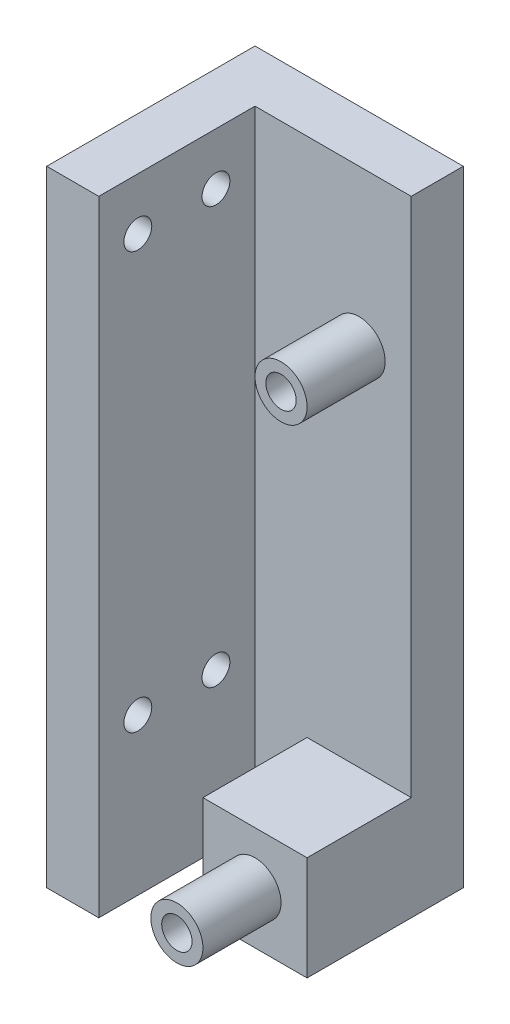
ISO-10303-21;
HEADER;
FILE_DESCRIPTION(('STEP AP214'),'2;1');
FILE_NAME('part.step','',(''),(''),'','','');
FILE_SCHEMA(('AUTOMOTIVE_DESIGN { 1 0 10303 214 1 1 1 1 }'));
ENDSEC;
DATA;
#1=APPLICATION_CONTEXT('core data for automotive mechanical design processes');
#2=APPLICATION_PROTOCOL_DEFINITION('international standard','automotive_design',2000,#1);
#3=PRODUCT_CONTEXT('',#1,'mechanical');
#4=PRODUCT('Part','Part','',(#3));
#5=PRODUCT_RELATED_PRODUCT_CATEGORY('part','',(#4));
#6=PRODUCT_DEFINITION_FORMATION('','',#4);
#7=PRODUCT_DEFINITION_CONTEXT('part definition',#1,'design');
#8=PRODUCT_DEFINITION('design','',#6,#7);
#9=PRODUCT_DEFINITION_SHAPE('','',#8);
#10=(LENGTH_UNIT() NAMED_UNIT(*) SI_UNIT(.MILLI.,.METRE.));
#11=(NAMED_UNIT(*) PLANE_ANGLE_UNIT() SI_UNIT($,.RADIAN.));
#12=(NAMED_UNIT(*) SI_UNIT($,.STERADIAN.) SOLID_ANGLE_UNIT());
#13=UNCERTAINTY_MEASURE_WITH_UNIT(LENGTH_MEASURE(1.E-05),#10,'distance_accuracy_value','');
#14=(GEOMETRIC_REPRESENTATION_CONTEXT(3) GLOBAL_UNCERTAINTY_ASSIGNED_CONTEXT((#13)) GLOBAL_UNIT_ASSIGNED_CONTEXT((#10,
#11,#12)) REPRESENTATION_CONTEXT('',''));
#15=CARTESIAN_POINT('',(0.,0.,0.));
#16=DIRECTION('',(0.,0.,1.));
#17=DIRECTION('',(1.,0.,0.));
#18=AXIS2_PLACEMENT_3D('',#15,#16,#17);
#19=CARTESIAN_POINT('',(0.,0.,-25.4));
#20=DIRECTION('',(-1.,0.,0.));
#21=DIRECTION('',(0.,-1.,0.));
#22=AXIS2_PLACEMENT_3D('',#19,#20,#21);
#23=PLANE('',#22);
#24=CARTESIAN_POINT('',(0.,69.85,-14.2875));
#25=DIRECTION('',(1.,0.,0.));
#26=DIRECTION('',(0.,1.,0.));
#27=AXIS2_PLACEMENT_3D('',#24,#25,#26);
#28=CIRCLE('',#27,1.700000029);
#29=CARTESIAN_POINT('',(0.,71.550000029,-14.2875));
#30=VERTEX_POINT('',#29);
#31=EDGE_CURVE('E231',#30,#30,#28,.T.);
#32=ORIENTED_EDGE('',*,*,#31,.T.);
#33=EDGE_LOOP('',(#32));
#34=FACE_BOUND('',#33,.T.);
#35=CARTESIAN_POINT('',(0.,19.0499999999999,-4.7625));
#36=DIRECTION('',(1.,0.,0.));
#37=DIRECTION('',(0.,1.,0.));
#38=AXIS2_PLACEMENT_3D('',#35,#36,#37);
#39=CIRCLE('',#38,1.700000029);
#40=CARTESIAN_POINT('',(0.,20.7500000289999,-4.7625));
#41=VERTEX_POINT('',#40);
#42=EDGE_CURVE('E235',#41,#41,#39,.T.);
#43=ORIENTED_EDGE('',*,*,#42,.T.);
#44=EDGE_LOOP('',(#43));
#45=FACE_BOUND('',#44,.T.);
#46=CARTESIAN_POINT('',(0.,19.05,-14.2875));
#47=DIRECTION('',(1.,0.,0.));
#48=DIRECTION('',(0.,1.,0.));
#49=AXIS2_PLACEMENT_3D('',#46,#47,#48);
#50=CIRCLE('',#49,1.700000029);
#51=CARTESIAN_POINT('',(0.,20.750000029,-14.2875));
#52=VERTEX_POINT('',#51);
#53=EDGE_CURVE('E239',#52,#52,#50,.T.);
#54=ORIENTED_EDGE('',*,*,#53,.T.);
#55=EDGE_LOOP('',(#54));
#56=FACE_BOUND('',#55,.T.);
#57=CARTESIAN_POINT('',(0.,69.85,-4.7625));
#58=DIRECTION('',(1.,0.,0.));
#59=DIRECTION('',(0.,1.,0.));
#60=AXIS2_PLACEMENT_3D('',#57,#58,#59);
#61=CIRCLE('',#60,1.700000029);
#62=CARTESIAN_POINT('',(0.,71.550000029,-4.7625));
#63=VERTEX_POINT('',#62);
#64=EDGE_CURVE('E243',#63,#63,#61,.T.);
#65=ORIENTED_EDGE('',*,*,#64,.T.);
#66=EDGE_LOOP('',(#65));
#67=FACE_BOUND('',#66,.T.);
#68=DIRECTION('',(0.,-1.,0.));
#69=VECTOR('',#68,1.);
#70=CARTESIAN_POINT('',(0.,0.,0.));
#71=LINE('',#70,#69);
#72=CARTESIAN_POINT('',(0.,76.2,0.));
#73=VERTEX_POINT('',#72);
#74=CARTESIAN_POINT('',(0.,0.,0.));
#75=VERTEX_POINT('',#74);
#76=EDGE_CURVE('E167',#73,#75,#71,.T.);
#77=ORIENTED_EDGE('',*,*,#76,.F.);
#78=DIRECTION('',(0.,0.,1.));
#79=VECTOR('',#78,1.);
#80=CARTESIAN_POINT('',(0.,76.2,-25.4));
#81=LINE('',#80,#79);
#82=CARTESIAN_POINT('',(0.,76.2,-25.4));
#83=VERTEX_POINT('',#82);
#84=EDGE_CURVE('E188',#83,#73,#81,.T.);
#85=ORIENTED_EDGE('',*,*,#84,.F.);
#86=DIRECTION('',(0.,-1.,0.));
#87=VECTOR('',#86,1.);
#88=CARTESIAN_POINT('',(0.,0.,-25.4));
#89=LINE('',#88,#87);
#90=CARTESIAN_POINT('',(0.,0.,-25.4));
#91=VERTEX_POINT('',#90);
#92=EDGE_CURVE('E168',#83,#91,#89,.T.);
#93=ORIENTED_EDGE('',*,*,#92,.T.);
#94=DIRECTION('',(0.,0.,1.));
#95=VECTOR('',#94,1.);
#96=CARTESIAN_POINT('',(0.,0.,-25.4));
#97=LINE('',#96,#95);
#98=EDGE_CURVE('E181',#91,#75,#97,.T.);
#99=ORIENTED_EDGE('',*,*,#98,.T.);
#100=EDGE_LOOP('',(#77,#85,#93,#99));
#101=FACE_BOUND('',#100,.T.);
#102=ADVANCED_FACE('F39',(#34,#45,#56,#67,#101),#23,.T.);
#103=CARTESIAN_POINT('',(0.,76.2,-25.4));
#104=DIRECTION('',(0.,1.,0.));
#105=DIRECTION('',(0.,0.,1.));
#106=AXIS2_PLACEMENT_3D('',#103,#104,#105);
#107=PLANE('',#106);
#108=DIRECTION('',(0.,0.,1.));
#109=VECTOR('',#108,1.);
#110=CARTESIAN_POINT('',(6.34999999999998,76.2,-19.05));
#111=LINE('',#110,#109);
#112=CARTESIAN_POINT('',(6.34999999999998,76.2,-19.05));
#113=VERTEX_POINT('',#112);
#114=CARTESIAN_POINT('',(6.34999999999998,76.2,0.));
#115=VERTEX_POINT('',#114);
#116=EDGE_CURVE('E61',#113,#115,#111,.T.);
#117=ORIENTED_EDGE('',*,*,#116,.F.);
#118=DIRECTION('',(1.,0.,0.));
#119=VECTOR('',#118,1.);
#120=CARTESIAN_POINT('',(-78.5451621680164,76.1999999999999,-19.05));
#121=LINE('',#120,#119);
#122=CARTESIAN_POINT('',(25.4,76.2,-19.05));
#123=VERTEX_POINT('',#122);
#124=EDGE_CURVE('E157',#113,#123,#121,.T.);
#125=ORIENTED_EDGE('',*,*,#124,.T.);
#126=DIRECTION('',(0.,0.,1.));
#127=VECTOR('',#126,1.);
#128=CARTESIAN_POINT('',(25.4,76.2,-25.4));
#129=LINE('',#128,#127);
#130=CARTESIAN_POINT('',(25.4,76.2,-25.4));
#131=VERTEX_POINT('',#130);
#132=EDGE_CURVE('E191',#131,#123,#129,.T.);
#133=ORIENTED_EDGE('',*,*,#132,.F.);
#134=DIRECTION('',(-1.,0.,0.));
#135=VECTOR('',#134,1.);
#136=CARTESIAN_POINT('',(0.,76.2,-25.4));
#137=LINE('',#136,#135);
#138=EDGE_CURVE('E178',#131,#83,#137,.T.);
#139=ORIENTED_EDGE('',*,*,#138,.T.);
#140=ORIENTED_EDGE('',*,*,#84,.T.);
#141=DIRECTION('',(-1.,0.,0.));
#142=VECTOR('',#141,1.);
#143=CARTESIAN_POINT('',(0.,76.2,0.));
#144=LINE('',#143,#142);
#145=EDGE_CURVE('E172',#115,#73,#144,.T.);
#146=ORIENTED_EDGE('',*,*,#145,.F.);
#147=EDGE_LOOP('',(#117,#125,#133,#139,#140,#146));
#148=FACE_BOUND('',#147,.T.);
#149=ADVANCED_FACE('F220',(#148),#107,.T.);
#150=CARTESIAN_POINT('',(25.4,0.,-25.4));
#151=DIRECTION('',(1.,0.,0.));
#152=DIRECTION('',(0.,1.,0.));
#153=AXIS2_PLACEMENT_3D('',#150,#151,#152);
#154=PLANE('',#153);
#155=DIRECTION('',(0.,1.,0.));
#156=VECTOR('',#155,1.);
#157=CARTESIAN_POINT('',(25.4,76.2,-19.05));
#158=LINE('',#157,#156);
#159=CARTESIAN_POINT('',(25.4,12.7,-19.05));
#160=VERTEX_POINT('',#159);
#161=EDGE_CURVE('E149',#160,#123,#158,.T.);
#162=ORIENTED_EDGE('',*,*,#161,.F.);
#163=DIRECTION('',(0.,0.,-1.));
#164=VECTOR('',#163,1.);
#165=CARTESIAN_POINT('',(25.4,12.7,-6.35));
#166=LINE('',#165,#164);
#167=CARTESIAN_POINT('',(25.4,12.7,-6.35));
#168=VERTEX_POINT('',#167);
#169=EDGE_CURVE('E53',#168,#160,#166,.T.);
#170=ORIENTED_EDGE('',*,*,#169,.F.);
#171=DIRECTION('',(0.,-1.,0.));
#172=VECTOR('',#171,1.);
#173=CARTESIAN_POINT('',(25.4,76.1999999999999,-6.35));
#174=LINE('',#173,#172);
#175=CARTESIAN_POINT('',(25.4,0.,-6.35000000000001));
#176=VERTEX_POINT('',#175);
#177=EDGE_CURVE('E126',#168,#176,#174,.T.);
#178=ORIENTED_EDGE('',*,*,#177,.T.);
#179=DIRECTION('',(0.,0.,1.));
#180=VECTOR('',#179,1.);
#181=CARTESIAN_POINT('',(25.4,0.,-25.4));
#182=LINE('',#181,#180);
#183=CARTESIAN_POINT('',(25.4,0.,-25.4));
#184=VERTEX_POINT('',#183);
#185=EDGE_CURVE('E194',#184,#176,#182,.T.);
#186=ORIENTED_EDGE('',*,*,#185,.F.);
#187=DIRECTION('',(0.,1.,0.));
#188=VECTOR('',#187,1.);
#189=CARTESIAN_POINT('',(25.4,0.,-25.4));
#190=LINE('',#189,#188);
#191=EDGE_CURVE('E175',#184,#131,#190,.T.);
#192=ORIENTED_EDGE('',*,*,#191,.T.);
#193=ORIENTED_EDGE('',*,*,#132,.T.);
#194=EDGE_LOOP('',(#162,#170,#178,#186,#192,#193));
#195=FACE_BOUND('',#194,.T.);
#196=ADVANCED_FACE('F225',(#195),#154,.T.);
#197=CARTESIAN_POINT('',(0.,0.,-25.4));
#198=DIRECTION('',(0.,-1.,0.));
#199=DIRECTION('',(0.,0.,-1.));
#200=AXIS2_PLACEMENT_3D('',#197,#198,#199);
#201=PLANE('',#200);
#202=DIRECTION('',(0.,0.,-1.));
#203=VECTOR('',#202,1.);
#204=CARTESIAN_POINT('',(6.34999999999999,0.,-19.05));
#205=LINE('',#204,#203);
#206=CARTESIAN_POINT('',(6.34999999999999,0.,0.));
#207=VERTEX_POINT('',#206);
#208=CARTESIAN_POINT('',(6.34999999999999,0.,-19.05));
#209=VERTEX_POINT('',#208);
#210=EDGE_CURVE('E159',#207,#209,#205,.T.);
#211=ORIENTED_EDGE('',*,*,#210,.F.);
#212=DIRECTION('',(1.,0.,0.));
#213=VECTOR('',#212,1.);
#214=CARTESIAN_POINT('',(0.,0.,0.));
#215=LINE('',#214,#213);
#216=EDGE_CURVE('E184',#75,#207,#215,.T.);
#217=ORIENTED_EDGE('',*,*,#216,.F.);
#218=ORIENTED_EDGE('',*,*,#98,.F.);
#219=DIRECTION('',(1.,0.,0.));
#220=VECTOR('',#219,1.);
#221=CARTESIAN_POINT('',(0.,0.,-25.4));
#222=LINE('',#221,#220);
#223=EDGE_CURVE('E171',#91,#184,#222,.T.);
#224=ORIENTED_EDGE('',*,*,#223,.T.);
#225=ORIENTED_EDGE('',*,*,#185,.T.);
#226=DIRECTION('',(-1.,0.,0.));
#227=VECTOR('',#226,1.);
#228=CARTESIAN_POINT('',(-78.5451621680164,0.,-6.35000000000001));
#229=LINE('',#228,#227);
#230=CARTESIAN_POINT('',(12.7,0.,-6.35000000000001));
#231=VERTEX_POINT('',#230);
#232=EDGE_CURVE('E116',#176,#231,#229,.T.);
#233=ORIENTED_EDGE('',*,*,#232,.T.);
#234=DIRECTION('',(0.,0.,-1.));
#235=VECTOR('',#234,1.);
#236=CARTESIAN_POINT('',(12.7,0.,-6.35000000000001));
#237=LINE('',#236,#235);
#238=CARTESIAN_POINT('',(12.7,0.,-19.05));
#239=VERTEX_POINT('',#238);
#240=EDGE_CURVE('E129',#231,#239,#237,.T.);
#241=ORIENTED_EDGE('',*,*,#240,.T.);
#242=DIRECTION('',(1.,0.,0.));
#243=VECTOR('',#242,1.);
#244=CARTESIAN_POINT('',(-78.5451621680164,0.,-19.05));
#245=LINE('',#244,#243);
#246=EDGE_CURVE('E158',#209,#239,#245,.T.);
#247=ORIENTED_EDGE('',*,*,#246,.F.);
#248=EDGE_LOOP('',(#211,#217,#218,#224,#225,#233,#241,#247));
#249=FACE_BOUND('',#248,.T.);
#250=ADVANCED_FACE('F257',(#249),#201,.T.);
#251=CARTESIAN_POINT('',(0.,0.,-25.4));
#252=DIRECTION('',(0.,0.,-1.));
#253=DIRECTION('',(-1.,0.,0.));
#254=AXIS2_PLACEMENT_3D('',#251,#252,#253);
#255=PLANE('',#254);
#256=ORIENTED_EDGE('',*,*,#92,.F.);
#257=ORIENTED_EDGE('',*,*,#138,.F.);
#258=ORIENTED_EDGE('',*,*,#191,.F.);
#259=ORIENTED_EDGE('',*,*,#223,.F.);
#260=EDGE_LOOP('',(#256,#257,#258,#259));
#261=FACE_BOUND('',#260,.T.);
#262=ADVANCED_FACE('F253',(#261),#255,.T.);
#263=CARTESIAN_POINT('',(0.,0.,0.));
#264=DIRECTION('',(0.,0.,-1.));
#265=DIRECTION('',(-1.,0.,0.));
#266=AXIS2_PLACEMENT_3D('',#263,#264,#265);
#267=PLANE('',#266);
#268=ORIENTED_EDGE('',*,*,#216,.T.);
#269=DIRECTION('',(0.,-1.,0.));
#270=VECTOR('',#269,1.);
#271=CARTESIAN_POINT('',(6.34999999999998,76.2,0.));
#272=LINE('',#271,#270);
#273=EDGE_CURVE('E154',#115,#207,#272,.T.);
#274=ORIENTED_EDGE('',*,*,#273,.F.);
#275=ORIENTED_EDGE('',*,*,#145,.T.);
#276=ORIENTED_EDGE('',*,*,#76,.T.);
#277=EDGE_LOOP('',(#268,#274,#275,#276));
#278=FACE_BOUND('',#277,.T.);
#279=ADVANCED_FACE('F248',(#278),#267,.F.);
#280=CARTESIAN_POINT('',(6.35,0.,-25.4));
#281=DIRECTION('',(-1.,0.,0.));
#282=DIRECTION('',(0.,-1.,0.));
#283=AXIS2_PLACEMENT_3D('',#280,#281,#282);
#284=PLANE('',#283);
#285=CARTESIAN_POINT('',(6.34999999999999,69.85,-14.2875));
#286=DIRECTION('',(1.,0.,0.));
#287=DIRECTION('',(0.,1.,0.));
#288=AXIS2_PLACEMENT_3D('',#285,#286,#287);
#289=CIRCLE('',#288,1.700000029);
#290=CARTESIAN_POINT('',(6.34999999999999,71.550000029,-14.2875));
#291=VERTEX_POINT('',#290);
#292=EDGE_CURVE('E279',#291,#291,#289,.T.);
#293=ORIENTED_EDGE('',*,*,#292,.F.);
#294=EDGE_LOOP('',(#293));
#295=FACE_BOUND('',#294,.T.);
#296=CARTESIAN_POINT('',(6.35,19.0499999999999,-4.7625));
#297=DIRECTION('',(1.,0.,0.));
#298=DIRECTION('',(0.,1.,0.));
#299=AXIS2_PLACEMENT_3D('',#296,#297,#298);
#300=CIRCLE('',#299,1.700000029);
#301=CARTESIAN_POINT('',(6.35,20.7500000289999,-4.7625));
#302=VERTEX_POINT('',#301);
#303=EDGE_CURVE('E283',#302,#302,#300,.T.);
#304=ORIENTED_EDGE('',*,*,#303,.F.);
#305=EDGE_LOOP('',(#304));
#306=FACE_BOUND('',#305,.T.);
#307=CARTESIAN_POINT('',(6.35,19.05,-14.2875));
#308=DIRECTION('',(1.,0.,0.));
#309=DIRECTION('',(0.,1.,0.));
#310=AXIS2_PLACEMENT_3D('',#307,#308,#309);
#311=CIRCLE('',#310,1.700000029);
#312=CARTESIAN_POINT('',(6.35,20.750000029,-14.2875));
#313=VERTEX_POINT('',#312);
#314=EDGE_CURVE('E287',#313,#313,#311,.T.);
#315=ORIENTED_EDGE('',*,*,#314,.F.);
#316=EDGE_LOOP('',(#315));
#317=FACE_BOUND('',#316,.T.);
#318=CARTESIAN_POINT('',(6.34999999999999,69.85,-4.7625));
#319=DIRECTION('',(1.,0.,0.));
#320=DIRECTION('',(0.,1.,0.));
#321=AXIS2_PLACEMENT_3D('',#318,#319,#320);
#322=CIRCLE('',#321,1.700000029);
#323=CARTESIAN_POINT('',(6.34999999999999,71.550000029,-4.7625));
#324=VERTEX_POINT('',#323);
#325=EDGE_CURVE('E290',#324,#324,#322,.T.);
#326=ORIENTED_EDGE('',*,*,#325,.F.);
#327=EDGE_LOOP('',(#326));
#328=FACE_BOUND('',#327,.T.);
#329=DIRECTION('',(0.,1.,0.));
#330=VECTOR('',#329,1.);
#331=CARTESIAN_POINT('',(6.34999999999998,76.2,-19.05));
#332=LINE('',#331,#330);
#333=EDGE_CURVE('E155',#209,#113,#332,.T.);
#334=ORIENTED_EDGE('',*,*,#333,.T.);
#335=ORIENTED_EDGE('',*,*,#116,.T.);
#336=ORIENTED_EDGE('',*,*,#273,.T.);
#337=ORIENTED_EDGE('',*,*,#210,.T.);
#338=EDGE_LOOP('',(#334,#335,#336,#337));
#339=FACE_BOUND('',#338,.T.);
#340=ADVANCED_FACE('F217',(#295,#306,#317,#328,#339),#284,.F.);
#341=CARTESIAN_POINT('',(-78.5451621680164,76.1999999999999,-19.05));
#342=DIRECTION('',(0.,0.,-1.));
#343=DIRECTION('',(0.,1.,0.));
#344=AXIS2_PLACEMENT_3D('',#341,#342,#343);
#345=PLANE('',#344);
#346=CARTESIAN_POINT('',(19.05,57.15,-19.05));
#347=DIRECTION('',(0.,0.,-1.));
#348=DIRECTION('',(0.,1.,0.));
#349=AXIS2_PLACEMENT_3D('',#346,#347,#348);
#350=CIRCLE('',#349,3.175);
#351=CARTESIAN_POINT('',(19.05,60.325,-19.05));
#352=VERTEX_POINT('',#351);
#353=EDGE_CURVE('E145',#352,#352,#350,.T.);
#354=ORIENTED_EDGE('',*,*,#353,.T.);
#355=EDGE_LOOP('',(#354));
#356=FACE_BOUND('',#355,.T.);
#357=ORIENTED_EDGE('',*,*,#246,.T.);
#358=DIRECTION('',(0.,1.,0.));
#359=VECTOR('',#358,1.);
#360=CARTESIAN_POINT('',(12.7,76.1999999999999,-19.05));
#361=LINE('',#360,#359);
#362=CARTESIAN_POINT('',(12.7,12.7,-19.05));
#363=VERTEX_POINT('',#362);
#364=EDGE_CURVE('E131',#239,#363,#361,.T.);
#365=ORIENTED_EDGE('',*,*,#364,.T.);
#366=DIRECTION('',(1.,0.,0.));
#367=VECTOR('',#366,1.);
#368=CARTESIAN_POINT('',(-78.5451621680164,12.7,-19.05));
#369=LINE('',#368,#367);
#370=EDGE_CURVE('E111',#363,#160,#369,.T.);
#371=ORIENTED_EDGE('',*,*,#370,.T.);
#372=ORIENTED_EDGE('',*,*,#161,.T.);
#373=ORIENTED_EDGE('',*,*,#124,.F.);
#374=ORIENTED_EDGE('',*,*,#333,.F.);
#375=EDGE_LOOP('',(#357,#365,#371,#372,#373,#374));
#376=FACE_BOUND('',#375,.T.);
#377=ADVANCED_FACE('F204',(#356,#376),#345,.F.);
#378=CARTESIAN_POINT('',(19.05,57.15,-9.525));
#379=DIRECTION('',(0.,0.,-1.));
#380=DIRECTION('',(-1.,0.,0.));
#381=AXIS2_PLACEMENT_3D('',#378,#379,#380);
#382=CYLINDRICAL_SURFACE('',#381,3.175);
#383=CARTESIAN_POINT('',(19.05,57.15,-9.525));
#384=DIRECTION('',(0.,0.,-1.));
#385=DIRECTION('',(0.,1.,0.));
#386=AXIS2_PLACEMENT_3D('',#383,#384,#385);
#387=CIRCLE('',#386,3.175);
#388=CARTESIAN_POINT('',(19.05,60.325,-9.525));
#389=VERTEX_POINT('',#388);
#390=EDGE_CURVE('E146',#389,#389,#387,.T.);
#391=ORIENTED_EDGE('',*,*,#390,.T.);
#392=EDGE_LOOP('',(#391));
#393=FACE_BOUND('',#392,.T.);
#394=ORIENTED_EDGE('',*,*,#353,.F.);
#395=EDGE_LOOP('',(#394));
#396=FACE_BOUND('',#395,.T.);
#397=ADVANCED_FACE('F216',(#393,#396),#382,.T.);
#398=CARTESIAN_POINT('',(19.05,57.15,-9.525));
#399=DIRECTION('',(0.,0.,-1.));
#400=DIRECTION('',(0.,1.,0.));
#401=AXIS2_PLACEMENT_3D('',#398,#399,#400);
#402=PLANE('',#401);
#403=CARTESIAN_POINT('',(19.05,57.15,-9.525));
#404=DIRECTION('',(0.,0.,-1.));
#405=DIRECTION('',(0.,1.,0.));
#406=AXIS2_PLACEMENT_3D('',#403,#404,#405);
#407=CIRCLE('',#406,1.84999998300001);
#408=CARTESIAN_POINT('',(19.05,58.999999983,-9.525));
#409=VERTEX_POINT('',#408);
#410=EDGE_CURVE('E141',#409,#409,#407,.T.);
#411=ORIENTED_EDGE('',*,*,#410,.T.);
#412=EDGE_LOOP('',(#411));
#413=FACE_BOUND('',#412,.T.);
#414=ORIENTED_EDGE('',*,*,#390,.F.);
#415=EDGE_LOOP('',(#414));
#416=FACE_BOUND('',#415,.T.);
#417=ADVANCED_FACE('F210',(#413,#416),#402,.F.);
#418=CARTESIAN_POINT('',(19.05,57.15,-9.525));
#419=DIRECTION('',(0.,0.,-1.));
#420=DIRECTION('',(-1.,0.,0.));
#421=AXIS2_PLACEMENT_3D('',#418,#419,#420);
#422=CYLINDRICAL_SURFACE('',#421,1.84999998300001);
#423=ORIENTED_EDGE('',*,*,#410,.F.);
#424=EDGE_LOOP('',(#423));
#425=FACE_BOUND('',#424,.T.);
#426=CARTESIAN_POINT('',(19.05,57.15,-19.05));
#427=DIRECTION('',(0.,0.,-1.));
#428=DIRECTION('',(0.,1.,0.));
#429=AXIS2_PLACEMENT_3D('',#426,#427,#428);
#430=CIRCLE('',#429,1.84999998300001);
#431=CARTESIAN_POINT('',(19.05,58.999999983,-19.05));
#432=VERTEX_POINT('',#431);
#433=EDGE_CURVE('E46',#432,#432,#430,.T.);
#434=ORIENTED_EDGE('',*,*,#433,.T.);
#435=EDGE_LOOP('',(#434));
#436=FACE_BOUND('',#435,.T.);
#437=ADVANCED_FACE('F199',(#425,#436),#422,.F.);
#438=ORIENTED_EDGE('',*,*,#433,.F.);
#439=EDGE_LOOP('',(#438));
#440=FACE_BOUND('',#439,.T.);
#441=ADVANCED_FACE('F201',(#440),#345,.F.);
#442=CARTESIAN_POINT('',(12.7,76.1999999999999,-6.35));
#443=DIRECTION('',(-1.,0.,0.));
#444=DIRECTION('',(0.,0.,1.));
#445=AXIS2_PLACEMENT_3D('',#442,#443,#444);
#446=PLANE('',#445);
#447=ORIENTED_EDGE('',*,*,#364,.F.);
#448=ORIENTED_EDGE('',*,*,#240,.F.);
#449=DIRECTION('',(0.,1.,0.));
#450=VECTOR('',#449,1.);
#451=CARTESIAN_POINT('',(12.7,76.1999999999999,-6.35));
#452=LINE('',#451,#450);
#453=CARTESIAN_POINT('',(12.7,12.7,-6.35));
#454=VERTEX_POINT('',#453);
#455=EDGE_CURVE('E123',#231,#454,#452,.T.);
#456=ORIENTED_EDGE('',*,*,#455,.T.);
#457=DIRECTION('',(0.,0.,-1.));
#458=VECTOR('',#457,1.);
#459=CARTESIAN_POINT('',(12.7,12.7,-6.35));
#460=LINE('',#459,#458);
#461=EDGE_CURVE('E107',#454,#363,#460,.T.);
#462=ORIENTED_EDGE('',*,*,#461,.T.);
#463=EDGE_LOOP('',(#447,#448,#456,#462));
#464=FACE_BOUND('',#463,.T.);
#465=ADVANCED_FACE('F128',(#464),#446,.T.);
#466=CARTESIAN_POINT('',(-78.5451621680164,12.7,-6.35));
#467=DIRECTION('',(0.,1.,0.));
#468=DIRECTION('',(0.,0.,1.));
#469=AXIS2_PLACEMENT_3D('',#466,#467,#468);
#470=PLANE('',#469);
#471=ORIENTED_EDGE('',*,*,#370,.F.);
#472=ORIENTED_EDGE('',*,*,#461,.F.);
#473=DIRECTION('',(1.,0.,0.));
#474=VECTOR('',#473,1.);
#475=CARTESIAN_POINT('',(-78.5451621680164,12.7,-6.35));
#476=LINE('',#475,#474);
#477=EDGE_CURVE('E110',#454,#168,#476,.T.);
#478=ORIENTED_EDGE('',*,*,#477,.T.);
#479=ORIENTED_EDGE('',*,*,#169,.T.);
#480=EDGE_LOOP('',(#471,#472,#478,#479));
#481=FACE_BOUND('',#480,.T.);
#482=ADVANCED_FACE('F109',(#481),#470,.T.);
#483=CARTESIAN_POINT('',(0.,0.,-6.35));
#484=DIRECTION('',(0.,0.,-1.));
#485=DIRECTION('',(0.,1.,0.));
#486=AXIS2_PLACEMENT_3D('',#483,#484,#485);
#487=PLANE('',#486);
#488=CARTESIAN_POINT('',(19.05,6.35,-6.35));
#489=DIRECTION('',(0.,0.,-1.));
#490=DIRECTION('',(0.,1.,0.));
#491=AXIS2_PLACEMENT_3D('',#488,#489,#490);
#492=CIRCLE('',#491,3.175);
#493=CARTESIAN_POINT('',(19.05,9.525,-6.35));
#494=VERTEX_POINT('',#493);
#495=EDGE_CURVE('E12',#494,#494,#492,.F.);
#496=ORIENTED_EDGE('',*,*,#495,.F.);
#497=EDGE_LOOP('',(#496));
#498=FACE_BOUND('',#497,.T.);
#499=ORIENTED_EDGE('',*,*,#455,.F.);
#500=ORIENTED_EDGE('',*,*,#232,.F.);
#501=ORIENTED_EDGE('',*,*,#177,.F.);
#502=ORIENTED_EDGE('',*,*,#477,.F.);
#503=EDGE_LOOP('',(#499,#500,#501,#502));
#504=FACE_BOUND('',#503,.T.);
#505=ADVANCED_FACE('F121',(#498,#504),#487,.F.);
#506=CARTESIAN_POINT('',(19.05,6.35,3.175));
#507=DIRECTION('',(0.,0.,1.));
#508=DIRECTION('',(1.,0.,0.));
#509=AXIS2_PLACEMENT_3D('',#506,#507,#508);
#510=PLANE('',#509);
#511=CARTESIAN_POINT('',(19.05,6.35,3.175));
#512=DIRECTION('',(0.,0.,1.));
#513=DIRECTION('',(1.,0.,0.));
#514=AXIS2_PLACEMENT_3D('',#511,#512,#513);
#515=CIRCLE('',#514,3.175);
#516=CARTESIAN_POINT('',(22.225,6.35,3.175));
#517=VERTEX_POINT('',#516);
#518=EDGE_CURVE('E134',#517,#517,#515,.T.);
#519=ORIENTED_EDGE('',*,*,#518,.T.);
#520=EDGE_LOOP('',(#519));
#521=FACE_BOUND('',#520,.T.);
#522=CARTESIAN_POINT('',(19.05,6.35,3.175));
#523=DIRECTION('',(0.,0.,1.));
#524=DIRECTION('',(1.,0.,0.));
#525=AXIS2_PLACEMENT_3D('',#522,#523,#524);
#526=CIRCLE('',#525,1.84999998300001);
#527=CARTESIAN_POINT('',(20.899999983,6.35,3.175));
#528=VERTEX_POINT('',#527);
#529=EDGE_CURVE('E298',#528,#528,#526,.T.);
#530=ORIENTED_EDGE('',*,*,#529,.F.);
#531=EDGE_LOOP('',(#530));
#532=FACE_BOUND('',#531,.T.);
#533=ADVANCED_FACE('F316',(#521,#532),#510,.T.);
#534=CARTESIAN_POINT('',(19.05,6.35,3.175));
#535=DIRECTION('',(0.,0.,-1.));
#536=DIRECTION('',(-1.,0.,0.));
#537=AXIS2_PLACEMENT_3D('',#534,#535,#536);
#538=CYLINDRICAL_SURFACE('',#537,3.175);
#539=ORIENTED_EDGE('',*,*,#518,.F.);
#540=EDGE_LOOP('',(#539));
#541=FACE_BOUND('',#540,.T.);
#542=ORIENTED_EDGE('',*,*,#495,.T.);
#543=EDGE_LOOP('',(#542));
#544=FACE_BOUND('',#543,.T.);
#545=ADVANCED_FACE('F307',(#541,#544),#538,.T.);
#546=CARTESIAN_POINT('',(19.05,6.35,3.175));
#547=DIRECTION('',(0.,0.,-1.));
#548=DIRECTION('',(-1.,0.,0.));
#549=AXIS2_PLACEMENT_3D('',#546,#547,#548);
#550=CYLINDRICAL_SURFACE('',#549,1.84999998300001);
#551=ORIENTED_EDGE('',*,*,#529,.T.);
#552=EDGE_LOOP('',(#551));
#553=FACE_BOUND('',#552,.T.);
#554=CARTESIAN_POINT('',(19.05,6.35,-6.35));
#555=DIRECTION('',(0.,0.,1.));
#556=DIRECTION('',(1.,0.,0.));
#557=AXIS2_PLACEMENT_3D('',#554,#555,#556);
#558=CIRCLE('',#557,1.84999998300001);
#559=CARTESIAN_POINT('',(20.899999983,6.35,-6.35));
#560=VERTEX_POINT('',#559);
#561=EDGE_CURVE('E293',#560,#560,#558,.T.);
#562=ORIENTED_EDGE('',*,*,#561,.F.);
#563=EDGE_LOOP('',(#562));
#564=FACE_BOUND('',#563,.T.);
#565=ADVANCED_FACE('F305',(#553,#564),#550,.F.);
#566=ORIENTED_EDGE('',*,*,#561,.T.);
#567=EDGE_LOOP('',(#566));
#568=FACE_BOUND('',#567,.T.);
#569=ADVANCED_FACE('F303',(#568),#487,.F.);
#570=CARTESIAN_POINT('',(0.,69.85,-4.7625));
#571=DIRECTION('',(1.,0.,0.));
#572=DIRECTION('',(0.,1.,0.));
#573=AXIS2_PLACEMENT_3D('',#570,#571,#572);
#574=CYLINDRICAL_SURFACE('',#573,1.700000029);
#575=ORIENTED_EDGE('',*,*,#64,.F.);
#576=EDGE_LOOP('',(#575));
#577=FACE_BOUND('',#576,.T.);
#578=ORIENTED_EDGE('',*,*,#325,.T.);
#579=EDGE_LOOP('',(#578));
#580=FACE_BOUND('',#579,.T.);
#581=ADVANCED_FACE('F314',(#577,#580),#574,.F.);
#582=CARTESIAN_POINT('',(0.,19.05,-14.2875));
#583=DIRECTION('',(1.,0.,0.));
#584=DIRECTION('',(0.,1.,0.));
#585=AXIS2_PLACEMENT_3D('',#582,#583,#584);
#586=CYLINDRICAL_SURFACE('',#585,1.700000029);
#587=ORIENTED_EDGE('',*,*,#53,.F.);
#588=EDGE_LOOP('',(#587));
#589=FACE_BOUND('',#588,.T.);
#590=ORIENTED_EDGE('',*,*,#314,.T.);
#591=EDGE_LOOP('',(#590));
#592=FACE_BOUND('',#591,.T.);
#593=ADVANCED_FACE('F440',(#589,#592),#586,.F.);
#594=CARTESIAN_POINT('',(0.,19.0499999999999,-4.7625));
#595=DIRECTION('',(1.,0.,0.));
#596=DIRECTION('',(0.,1.,0.));
#597=AXIS2_PLACEMENT_3D('',#594,#595,#596);
#598=CYLINDRICAL_SURFACE('',#597,1.700000029);
#599=ORIENTED_EDGE('',*,*,#42,.F.);
#600=EDGE_LOOP('',(#599));
#601=FACE_BOUND('',#600,.T.);
#602=ORIENTED_EDGE('',*,*,#303,.T.);
#603=EDGE_LOOP('',(#602));
#604=FACE_BOUND('',#603,.T.);
#605=ADVANCED_FACE('F450',(#601,#604),#598,.F.);
#606=CARTESIAN_POINT('',(0.,69.85,-14.2875));
#607=DIRECTION('',(1.,0.,0.));
#608=DIRECTION('',(0.,1.,0.));
#609=AXIS2_PLACEMENT_3D('',#606,#607,#608);
#610=CYLINDRICAL_SURFACE('',#609,1.700000029);
#611=ORIENTED_EDGE('',*,*,#31,.F.);
#612=EDGE_LOOP('',(#611));
#613=FACE_BOUND('',#612,.T.);
#614=ORIENTED_EDGE('',*,*,#292,.T.);
#615=EDGE_LOOP('',(#614));
#616=FACE_BOUND('',#615,.T.);
#617=ADVANCED_FACE('F461',(#613,#616),#610,.F.);
#618=CLOSED_SHELL('',(#102,#149,#196,#250,#262,#279,#340,#377,#397,#417,#437,#441,#465,#482,
#505,#533,#545,#565,#569,#581,#593,#605,#617));
#619=MANIFOLD_SOLID_BREP('B2',#618);
#620=ADVANCED_BREP_SHAPE_REPRESENTATION('',(#18,#619),#14);
#621=SHAPE_DEFINITION_REPRESENTATION(#9,#620);
ENDSEC;
END-ISO-10303-21;
